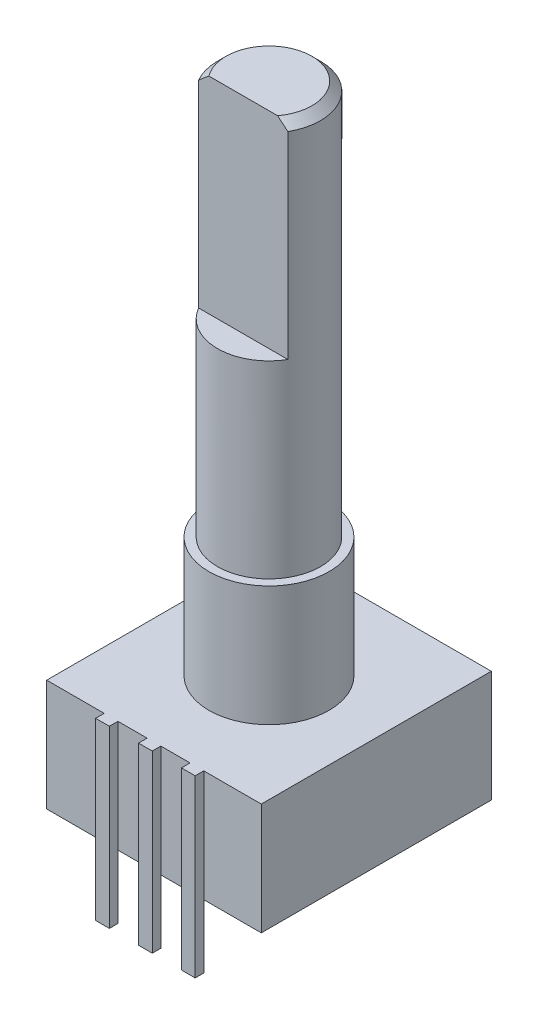
ISO-10303-21;
HEADER;
FILE_DESCRIPTION(('STEP AP214'),'2;1');
FILE_NAME('part.step','',(''),(''),'','','');
FILE_SCHEMA(('AUTOMOTIVE_DESIGN { 1 0 10303 214 1 1 1 1 }'));
ENDSEC;
DATA;
#1=APPLICATION_CONTEXT('core data for automotive mechanical design processes');
#2=APPLICATION_PROTOCOL_DEFINITION('international standard','automotive_design',2000,#1);
#3=PRODUCT_CONTEXT('',#1,'mechanical');
#4=PRODUCT('Part','Part','',(#3));
#5=PRODUCT_RELATED_PRODUCT_CATEGORY('part','',(#4));
#6=PRODUCT_DEFINITION_FORMATION('','',#4);
#7=PRODUCT_DEFINITION_CONTEXT('part definition',#1,'design');
#8=PRODUCT_DEFINITION('design','',#6,#7);
#9=PRODUCT_DEFINITION_SHAPE('','',#8);
#10=(LENGTH_UNIT() NAMED_UNIT(*) SI_UNIT(.MILLI.,.METRE.));
#11=(NAMED_UNIT(*) PLANE_ANGLE_UNIT() SI_UNIT($,.RADIAN.));
#12=(NAMED_UNIT(*) SI_UNIT($,.STERADIAN.) SOLID_ANGLE_UNIT());
#13=UNCERTAINTY_MEASURE_WITH_UNIT(LENGTH_MEASURE(1.E-05),#10,'distance_accuracy_value','');
#14=(GEOMETRIC_REPRESENTATION_CONTEXT(3) GLOBAL_UNCERTAINTY_ASSIGNED_CONTEXT((#13)) GLOBAL_UNIT_ASSIGNED_CONTEXT((#10,
#11,#12)) REPRESENTATION_CONTEXT('',''));
#15=CARTESIAN_POINT('',(0.,0.,0.));
#16=DIRECTION('',(0.,0.,1.));
#17=DIRECTION('',(1.,0.,0.));
#18=AXIS2_PLACEMENT_3D('',#15,#16,#17);
#19=CARTESIAN_POINT('',(6.25,-6.5,6.7));
#20=DIRECTION('',(0.,0.,1.));
#21=DIRECTION('',(1.,0.,0.));
#22=AXIS2_PLACEMENT_3D('',#19,#20,#21);
#23=PLANE('',#22);
#24=DIRECTION('',(1.,0.,0.));
#25=VECTOR('',#24,1.);
#26=CARTESIAN_POINT('',(6.25,-6.5,6.7));
#27=LINE('',#26,#25);
#28=CARTESIAN_POINT('',(0.400000000000001,-6.5,6.7));
#29=VERTEX_POINT('',#28);
#30=CARTESIAN_POINT('',(2.1,-6.5,6.7));
#31=VERTEX_POINT('',#30);
#32=EDGE_CURVE('E403',#29,#31,#27,.T.);
#33=ORIENTED_EDGE('',*,*,#32,.T.);
#34=DIRECTION('',(0.,-1.,0.));
#35=VECTOR('',#34,1.);
#36=CARTESIAN_POINT('',(2.1,0.,6.7));
#37=LINE('',#36,#35);
#38=CARTESIAN_POINT('',(2.1,0.,6.7));
#39=VERTEX_POINT('',#38);
#40=EDGE_CURVE('E404',#39,#31,#37,.T.);
#41=ORIENTED_EDGE('',*,*,#40,.F.);
#42=DIRECTION('',(1.,0.,0.));
#43=VECTOR('',#42,1.);
#44=CARTESIAN_POINT('',(6.25,0.,6.7));
#45=LINE('',#44,#43);
#46=CARTESIAN_POINT('',(0.400000000000001,0.,6.7));
#47=VERTEX_POINT('',#46);
#48=EDGE_CURVE('E220',#47,#39,#45,.T.);
#49=ORIENTED_EDGE('',*,*,#48,.F.);
#50=DIRECTION('',(0.,1.,0.));
#51=VECTOR('',#50,1.);
#52=CARTESIAN_POINT('',(0.4,0.,6.7));
#53=LINE('',#52,#51);
#54=EDGE_CURVE('E256',#29,#47,#53,.T.);
#55=ORIENTED_EDGE('',*,*,#54,.F.);
#56=EDGE_LOOP('',(#33,#41,#49,#55));
#57=FACE_BOUND('',#56,.T.);
#58=ADVANCED_FACE('F41',(#57),#23,.T.);
#59=CARTESIAN_POINT('',(2.9,0.,6.7));
#60=VERTEX_POINT('',#59);
#61=CARTESIAN_POINT('',(6.25,0.,6.7));
#62=VERTEX_POINT('',#61);
#63=EDGE_CURVE('E46',#60,#62,#45,.T.);
#64=ORIENTED_EDGE('',*,*,#63,.F.);
#65=DIRECTION('',(0.,1.,0.));
#66=VECTOR('',#65,1.);
#67=CARTESIAN_POINT('',(2.9,0.,6.7));
#68=LINE('',#67,#66);
#69=CARTESIAN_POINT('',(2.9,-6.5,6.7));
#70=VERTEX_POINT('',#69);
#71=EDGE_CURVE('E824',#70,#60,#68,.T.);
#72=ORIENTED_EDGE('',*,*,#71,.F.);
#73=CARTESIAN_POINT('',(6.25,-6.5,6.7));
#74=VERTEX_POINT('',#73);
#75=EDGE_CURVE('E407',#70,#74,#27,.T.);
#76=ORIENTED_EDGE('',*,*,#75,.T.);
#77=DIRECTION('',(0.,1.,0.));
#78=VECTOR('',#77,1.);
#79=CARTESIAN_POINT('',(6.25,-6.5,6.7));
#80=LINE('',#79,#78);
#81=EDGE_CURVE('E430',#74,#62,#80,.T.);
#82=ORIENTED_EDGE('',*,*,#81,.T.);
#83=EDGE_LOOP('',(#64,#72,#76,#82));
#84=FACE_BOUND('',#83,.T.);
#85=ADVANCED_FACE('F391',(#84),#23,.T.);
#86=CARTESIAN_POINT('',(-2.1,-6.5,6.7));
#87=VERTEX_POINT('',#86);
#88=CARTESIAN_POINT('',(-0.399999999999999,-6.5,6.7));
#89=VERTEX_POINT('',#88);
#90=EDGE_CURVE('E406',#87,#89,#27,.T.);
#91=ORIENTED_EDGE('',*,*,#90,.T.);
#92=DIRECTION('',(0.,-1.,0.));
#93=VECTOR('',#92,1.);
#94=CARTESIAN_POINT('',(-0.4,0.,6.7));
#95=LINE('',#94,#93);
#96=CARTESIAN_POINT('',(-0.4,0.,6.7));
#97=VERTEX_POINT('',#96);
#98=EDGE_CURVE('E249',#97,#89,#95,.T.);
#99=ORIENTED_EDGE('',*,*,#98,.F.);
#100=CARTESIAN_POINT('',(-2.1,0.,6.7));
#101=VERTEX_POINT('',#100);
#102=EDGE_CURVE('E316',#101,#97,#45,.T.);
#103=ORIENTED_EDGE('',*,*,#102,.F.);
#104=DIRECTION('',(0.,1.,0.));
#105=VECTOR('',#104,1.);
#106=CARTESIAN_POINT('',(-2.1,0.,6.7));
#107=LINE('',#106,#105);
#108=EDGE_CURVE('E12',#87,#101,#107,.T.);
#109=ORIENTED_EDGE('',*,*,#108,.F.);
#110=EDGE_LOOP('',(#91,#99,#103,#109));
#111=FACE_BOUND('',#110,.T.);
#112=ADVANCED_FACE('F385',(#111),#23,.T.);
#113=CARTESIAN_POINT('',(-6.25,-6.5,6.7));
#114=DIRECTION('',(-1.,0.,0.));
#115=DIRECTION('',(0.,0.,1.));
#116=AXIS2_PLACEMENT_3D('',#113,#114,#115);
#117=PLANE('',#116);
#118=DIRECTION('',(0.,0.,1.));
#119=VECTOR('',#118,1.);
#120=CARTESIAN_POINT('',(-6.25,0.,6.7));
#121=LINE('',#120,#119);
#122=CARTESIAN_POINT('',(-6.25,0.,-6.7));
#123=VERTEX_POINT('',#122);
#124=CARTESIAN_POINT('',(-6.25,0.,6.7));
#125=VERTEX_POINT('',#124);
#126=EDGE_CURVE('E320',#123,#125,#121,.T.);
#127=ORIENTED_EDGE('',*,*,#126,.F.);
#128=DIRECTION('',(0.,1.,0.));
#129=VECTOR('',#128,1.);
#130=CARTESIAN_POINT('',(-6.25,-6.5,-6.7));
#131=LINE('',#130,#129);
#132=CARTESIAN_POINT('',(-6.25,-6.5,-6.7));
#133=VERTEX_POINT('',#132);
#134=EDGE_CURVE('E442',#133,#123,#131,.T.);
#135=ORIENTED_EDGE('',*,*,#134,.F.);
#136=DIRECTION('',(0.,0.,1.));
#137=VECTOR('',#136,1.);
#138=CARTESIAN_POINT('',(-6.25,-6.5,6.7));
#139=LINE('',#138,#137);
#140=CARTESIAN_POINT('',(-6.25,-6.5,6.7));
#141=VERTEX_POINT('',#140);
#142=EDGE_CURVE('E415',#133,#141,#139,.T.);
#143=ORIENTED_EDGE('',*,*,#142,.T.);
#144=DIRECTION('',(0.,1.,0.));
#145=VECTOR('',#144,1.);
#146=CARTESIAN_POINT('',(-6.25,-6.5,6.7));
#147=LINE('',#146,#145);
#148=EDGE_CURVE('E427',#141,#125,#147,.T.);
#149=ORIENTED_EDGE('',*,*,#148,.T.);
#150=EDGE_LOOP('',(#127,#135,#143,#149));
#151=FACE_BOUND('',#150,.T.);
#152=ADVANCED_FACE('F378',(#151),#117,.T.);
#153=CARTESIAN_POINT('',(6.25,-6.5,-6.7));
#154=DIRECTION('',(0.,0.,-1.));
#155=DIRECTION('',(-1.,0.,0.));
#156=AXIS2_PLACEMENT_3D('',#153,#154,#155);
#157=PLANE('',#156);
#158=DIRECTION('',(-1.,0.,0.));
#159=VECTOR('',#158,1.);
#160=CARTESIAN_POINT('',(6.25,0.,-6.7));
#161=LINE('',#160,#159);
#162=CARTESIAN_POINT('',(6.25,0.,-6.7));
#163=VERTEX_POINT('',#162);
#164=EDGE_CURVE('E452',#163,#123,#161,.T.);
#165=ORIENTED_EDGE('',*,*,#164,.F.);
#166=DIRECTION('',(0.,1.,0.));
#167=VECTOR('',#166,1.);
#168=CARTESIAN_POINT('',(6.25,-6.5,-6.7));
#169=LINE('',#168,#167);
#170=CARTESIAN_POINT('',(6.25,-6.5,-6.7));
#171=VERTEX_POINT('',#170);
#172=EDGE_CURVE('E436',#171,#163,#169,.T.);
#173=ORIENTED_EDGE('',*,*,#172,.F.);
#174=DIRECTION('',(-1.,0.,0.));
#175=VECTOR('',#174,1.);
#176=CARTESIAN_POINT('',(6.25,-6.5,-6.7));
#177=LINE('',#176,#175);
#178=EDGE_CURVE('E424',#171,#133,#177,.T.);
#179=ORIENTED_EDGE('',*,*,#178,.T.);
#180=ORIENTED_EDGE('',*,*,#134,.T.);
#181=EDGE_LOOP('',(#165,#173,#179,#180));
#182=FACE_BOUND('',#181,.T.);
#183=ADVANCED_FACE('F374',(#182),#157,.T.);
#184=CARTESIAN_POINT('',(6.25,-6.5,6.7));
#185=DIRECTION('',(1.,0.,0.));
#186=DIRECTION('',(0.,0.,-1.));
#187=AXIS2_PLACEMENT_3D('',#184,#185,#186);
#188=PLANE('',#187);
#189=DIRECTION('',(0.,0.,-1.));
#190=VECTOR('',#189,1.);
#191=CARTESIAN_POINT('',(6.25,0.,6.7));
#192=LINE('',#191,#190);
#193=EDGE_CURVE('E322',#62,#163,#192,.T.);
#194=ORIENTED_EDGE('',*,*,#193,.F.);
#195=ORIENTED_EDGE('',*,*,#81,.F.);
#196=DIRECTION('',(0.,0.,-1.));
#197=VECTOR('',#196,1.);
#198=CARTESIAN_POINT('',(6.25,-6.5,6.7));
#199=LINE('',#198,#197);
#200=EDGE_CURVE('E420',#74,#171,#199,.T.);
#201=ORIENTED_EDGE('',*,*,#200,.T.);
#202=ORIENTED_EDGE('',*,*,#172,.T.);
#203=EDGE_LOOP('',(#194,#195,#201,#202));
#204=FACE_BOUND('',#203,.T.);
#205=ADVANCED_FACE('F377',(#204),#188,.T.);
#206=DIRECTION('',(0.,-1.,0.));
#207=VECTOR('',#206,1.);
#208=CARTESIAN_POINT('',(-2.9,0.,6.7));
#209=LINE('',#208,#207);
#210=CARTESIAN_POINT('',(-2.9,0.,6.7));
#211=VERTEX_POINT('',#210);
#212=CARTESIAN_POINT('',(-2.9,-6.5,6.7));
#213=VERTEX_POINT('',#212);
#214=EDGE_CURVE('E295',#211,#213,#209,.T.);
#215=ORIENTED_EDGE('',*,*,#214,.F.);
#216=EDGE_CURVE('E328',#125,#211,#45,.T.);
#217=ORIENTED_EDGE('',*,*,#216,.F.);
#218=ORIENTED_EDGE('',*,*,#148,.F.);
#219=EDGE_CURVE('E416',#141,#213,#27,.T.);
#220=ORIENTED_EDGE('',*,*,#219,.T.);
#221=EDGE_LOOP('',(#215,#217,#218,#220));
#222=FACE_BOUND('',#221,.T.);
#223=ADVANCED_FACE('F369',(#222),#23,.T.);
#224=CARTESIAN_POINT('',(0.,-6.5,0.));
#225=DIRECTION('',(0.,1.,0.));
#226=DIRECTION('',(0.,0.,1.));
#227=AXIS2_PLACEMENT_3D('',#224,#225,#226);
#228=PLANE('',#227);
#229=ORIENTED_EDGE('',*,*,#142,.F.);
#230=ORIENTED_EDGE('',*,*,#178,.F.);
#231=ORIENTED_EDGE('',*,*,#200,.F.);
#232=ORIENTED_EDGE('',*,*,#75,.F.);
#233=DIRECTION('',(-1.,0.,0.));
#234=VECTOR('',#233,1.);
#235=CARTESIAN_POINT('',(0.,-6.5,6.7));
#236=LINE('',#235,#234);
#237=EDGE_CURVE('E222',#70,#31,#236,.T.);
#238=ORIENTED_EDGE('',*,*,#237,.T.);
#239=ORIENTED_EDGE('',*,*,#32,.F.);
#240=DIRECTION('',(-1.,0.,0.));
#241=VECTOR('',#240,1.);
#242=CARTESIAN_POINT('',(0.,-6.5,6.7));
#243=LINE('',#242,#241);
#244=EDGE_CURVE('E273',#29,#89,#243,.T.);
#245=ORIENTED_EDGE('',*,*,#244,.T.);
#246=ORIENTED_EDGE('',*,*,#90,.F.);
#247=EDGE_CURVE('E413',#213,#87,#27,.T.);
#248=ORIENTED_EDGE('',*,*,#247,.F.);
#249=ORIENTED_EDGE('',*,*,#219,.F.);
#250=EDGE_LOOP('',(#229,#230,#231,#232,#238,#239,#245,#246,#248,#249));
#251=FACE_BOUND('',#250,.T.);
#252=ADVANCED_FACE('F366',(#251),#228,.F.);
#253=CARTESIAN_POINT('',(0.,0.,0.));
#254=DIRECTION('',(0.,1.,0.));
#255=DIRECTION('',(0.,0.,1.));
#256=AXIS2_PLACEMENT_3D('',#253,#254,#255);
#257=PLANE('',#256);
#258=CARTESIAN_POINT('',(0.,0.,0.));
#259=DIRECTION('',(0.,1.,0.));
#260=DIRECTION('',(0.,0.,1.));
#261=AXIS2_PLACEMENT_3D('',#258,#259,#260);
#262=CIRCLE('',#261,3.5);
#263=CARTESIAN_POINT('',(0.,0.,3.5));
#264=VERTEX_POINT('',#263);
#265=EDGE_CURVE('E470',#264,#264,#262,.T.);
#266=ORIENTED_EDGE('',*,*,#265,.F.);
#267=EDGE_LOOP('',(#266));
#268=FACE_BOUND('',#267,.T.);
#269=ORIENTED_EDGE('',*,*,#126,.T.);
#270=ORIENTED_EDGE('',*,*,#216,.T.);
#271=DIRECTION('',(0.,0.,-1.));
#272=VECTOR('',#271,1.);
#273=CARTESIAN_POINT('',(-2.9,0.,7.2));
#274=LINE('',#273,#272);
#275=CARTESIAN_POINT('',(-2.9,0.,7.2));
#276=VERTEX_POINT('',#275);
#277=EDGE_CURVE('E303',#276,#211,#274,.T.);
#278=ORIENTED_EDGE('',*,*,#277,.F.);
#279=DIRECTION('',(-1.,0.,0.));
#280=VECTOR('',#279,1.);
#281=CARTESIAN_POINT('',(-2.9,0.,7.2));
#282=LINE('',#281,#280);
#283=CARTESIAN_POINT('',(-2.1,0.,7.2));
#284=VERTEX_POINT('',#283);
#285=EDGE_CURVE('E278',#284,#276,#282,.T.);
#286=ORIENTED_EDGE('',*,*,#285,.F.);
#287=DIRECTION('',(0.,0.,-1.));
#288=VECTOR('',#287,1.);
#289=CARTESIAN_POINT('',(-2.1,0.,7.2));
#290=LINE('',#289,#288);
#291=EDGE_CURVE('E291',#284,#101,#290,.T.);
#292=ORIENTED_EDGE('',*,*,#291,.T.);
#293=ORIENTED_EDGE('',*,*,#102,.T.);
#294=DIRECTION('',(0.,0.,-1.));
#295=VECTOR('',#294,1.);
#296=CARTESIAN_POINT('',(-0.4,0.,7.2));
#297=LINE('',#296,#295);
#298=CARTESIAN_POINT('',(-0.4,0.,7.2));
#299=VERTEX_POINT('',#298);
#300=EDGE_CURVE('E270',#299,#97,#297,.T.);
#301=ORIENTED_EDGE('',*,*,#300,.F.);
#302=DIRECTION('',(-1.,0.,0.));
#303=VECTOR('',#302,1.);
#304=CARTESIAN_POINT('',(-0.4,0.,7.2));
#305=LINE('',#304,#303);
#306=CARTESIAN_POINT('',(0.4,0.,7.2));
#307=VERTEX_POINT('',#306);
#308=EDGE_CURVE('E235',#307,#299,#305,.T.);
#309=ORIENTED_EDGE('',*,*,#308,.F.);
#310=DIRECTION('',(0.,0.,-1.));
#311=VECTOR('',#310,1.);
#312=CARTESIAN_POINT('',(0.4,0.,7.2));
#313=LINE('',#312,#311);
#314=EDGE_CURVE('E68',#307,#47,#313,.T.);
#315=ORIENTED_EDGE('',*,*,#314,.T.);
#316=ORIENTED_EDGE('',*,*,#48,.T.);
#317=DIRECTION('',(0.,0.,-1.));
#318=VECTOR('',#317,1.);
#319=CARTESIAN_POINT('',(2.1,0.,7.2));
#320=LINE('',#319,#318);
#321=CARTESIAN_POINT('',(2.1,0.,7.2));
#322=VERTEX_POINT('',#321);
#323=EDGE_CURVE('E201',#322,#39,#320,.T.);
#324=ORIENTED_EDGE('',*,*,#323,.F.);
#325=DIRECTION('',(-1.,0.,0.));
#326=VECTOR('',#325,1.);
#327=CARTESIAN_POINT('',(2.1,0.,7.2));
#328=LINE('',#327,#326);
#329=CARTESIAN_POINT('',(2.9,0.,7.2));
#330=VERTEX_POINT('',#329);
#331=EDGE_CURVE('E209',#330,#322,#328,.T.);
#332=ORIENTED_EDGE('',*,*,#331,.F.);
#333=DIRECTION('',(0.,0.,-1.));
#334=VECTOR('',#333,1.);
#335=CARTESIAN_POINT('',(2.9,0.,7.2));
#336=LINE('',#335,#334);
#337=EDGE_CURVE('E61',#330,#60,#336,.T.);
#338=ORIENTED_EDGE('',*,*,#337,.T.);
#339=ORIENTED_EDGE('',*,*,#63,.T.);
#340=ORIENTED_EDGE('',*,*,#193,.T.);
#341=ORIENTED_EDGE('',*,*,#164,.T.);
#342=EDGE_LOOP('',(#269,#270,#278,#286,#292,#293,#301,#309,#315,#316,#324,#332,#338,#339,#340,#341));
#343=FACE_BOUND('',#342,.T.);
#344=ADVANCED_FACE('F218',(#268,#343),#257,.T.);
#345=CARTESIAN_POINT('',(0.,7.,0.));
#346=DIRECTION('',(0.,-1.,0.));
#347=DIRECTION('',(0.,0.,-1.));
#348=AXIS2_PLACEMENT_3D('',#345,#346,#347);
#349=CYLINDRICAL_SURFACE('',#348,3.5);
#350=CARTESIAN_POINT('',(0.,7.,0.));
#351=DIRECTION('',(0.,1.,0.));
#352=DIRECTION('',(0.,0.,1.));
#353=AXIS2_PLACEMENT_3D('',#350,#351,#352);
#354=CIRCLE('',#353,3.5);
#355=CARTESIAN_POINT('',(0.,7.,3.5));
#356=VERTEX_POINT('',#355);
#357=EDGE_CURVE('E467',#356,#356,#354,.T.);
#358=ORIENTED_EDGE('',*,*,#357,.F.);
#359=EDGE_LOOP('',(#358));
#360=FACE_BOUND('',#359,.T.);
#361=ORIENTED_EDGE('',*,*,#265,.T.);
#362=EDGE_LOOP('',(#361));
#363=FACE_BOUND('',#362,.T.);
#364=ADVANCED_FACE('F361',(#360,#363),#349,.T.);
#365=CARTESIAN_POINT('',(0.,7.,0.));
#366=DIRECTION('',(0.,1.,0.));
#367=DIRECTION('',(0.,0.,1.));
#368=AXIS2_PLACEMENT_3D('',#365,#366,#367);
#369=PLANE('',#368);
#370=CARTESIAN_POINT('',(0.,7.,0.));
#371=DIRECTION('',(0.,1.,0.));
#372=DIRECTION('',(0.,0.,1.));
#373=AXIS2_PLACEMENT_3D('',#370,#371,#372);
#374=CIRCLE('',#373,3.);
#375=CARTESIAN_POINT('',(0.,7.,3.));
#376=VERTEX_POINT('',#375);
#377=EDGE_CURVE('E476',#376,#376,#374,.T.);
#378=ORIENTED_EDGE('',*,*,#377,.F.);
#379=EDGE_LOOP('',(#378));
#380=FACE_BOUND('',#379,.T.);
#381=ORIENTED_EDGE('',*,*,#357,.T.);
#382=EDGE_LOOP('',(#381));
#383=FACE_BOUND('',#382,.T.);
#384=ADVANCED_FACE('F357',(#380,#383),#369,.T.);
#385=CARTESIAN_POINT('',(0.,30.,0.));
#386=DIRECTION('',(0.,-1.,0.));
#387=DIRECTION('',(0.,0.,-1.));
#388=AXIS2_PLACEMENT_3D('',#385,#386,#387);
#389=CYLINDRICAL_SURFACE('',#388,3.);
#390=CARTESIAN_POINT('',(0.,29.5,0.));
#391=DIRECTION('',(0.,1.,0.));
#392=DIRECTION('',(0.,0.,1.));
#393=AXIS2_PLACEMENT_3D('',#390,#391,#392);
#394=CIRCLE('',#393,3.);
#395=CARTESIAN_POINT('',(-2.59807621135332,29.5,1.5));
#396=VERTEX_POINT('',#395);
#397=CARTESIAN_POINT('',(2.59807621135332,29.5,1.5));
#398=VERTEX_POINT('',#397);
#399=EDGE_CURVE('E340',#396,#398,#394,.F.);
#400=ORIENTED_EDGE('',*,*,#399,.T.);
#401=DIRECTION('',(0.,1.,0.));
#402=VECTOR('',#401,1.);
#403=CARTESIAN_POINT('',(2.59807621135332,18.,1.5));
#404=LINE('',#403,#402);
#405=CARTESIAN_POINT('',(2.59807621135332,18.,1.5));
#406=VERTEX_POINT('',#405);
#407=EDGE_CURVE('E482',#406,#398,#404,.T.);
#408=ORIENTED_EDGE('',*,*,#407,.F.);
#409=CARTESIAN_POINT('',(0.,18.,0.));
#410=DIRECTION('',(0.,1.,0.));
#411=DIRECTION('',(0.,0.,1.));
#412=AXIS2_PLACEMENT_3D('',#409,#410,#411);
#413=CIRCLE('',#412,3.);
#414=CARTESIAN_POINT('',(-2.59807621135332,18.,1.5));
#415=VERTEX_POINT('',#414);
#416=EDGE_CURVE('E491',#415,#406,#413,.T.);
#417=ORIENTED_EDGE('',*,*,#416,.F.);
#418=DIRECTION('',(0.,1.,0.));
#419=VECTOR('',#418,1.);
#420=CARTESIAN_POINT('',(-2.59807621135332,18.,1.5));
#421=LINE('',#420,#419);
#422=EDGE_CURVE('E481',#415,#396,#421,.T.);
#423=ORIENTED_EDGE('',*,*,#422,.T.);
#424=EDGE_LOOP('',(#400,#408,#417,#423));
#425=FACE_BOUND('',#424,.T.);
#426=ORIENTED_EDGE('',*,*,#377,.T.);
#427=EDGE_LOOP('',(#426));
#428=FACE_BOUND('',#427,.T.);
#429=ADVANCED_FACE('F353',(#425,#428),#389,.T.);
#430=CARTESIAN_POINT('',(0.,30.,0.));
#431=DIRECTION('',(0.,1.,0.));
#432=DIRECTION('',(0.,0.,1.));
#433=AXIS2_PLACEMENT_3D('',#430,#431,#432);
#434=PLANE('',#433);
#435=DIRECTION('',(-1.,0.,0.));
#436=VECTOR('',#435,1.);
#437=CARTESIAN_POINT('',(-2.59807621135332,30.,1.5));
#438=LINE('',#437,#436);
#439=CARTESIAN_POINT('',(2.00000000000001,30.,1.5));
#440=VERTEX_POINT('',#439);
#441=CARTESIAN_POINT('',(-2.00000000000001,30.,1.5));
#442=VERTEX_POINT('',#441);
#443=EDGE_CURVE('E306',#440,#442,#438,.T.);
#444=ORIENTED_EDGE('',*,*,#443,.F.);
#445=CARTESIAN_POINT('',(0.,30.,0.));
#446=DIRECTION('',(0.,1.,0.));
#447=DIRECTION('',(0.,0.,1.));
#448=AXIS2_PLACEMENT_3D('',#445,#446,#447);
#449=CIRCLE('',#448,2.50000000000001);
#450=EDGE_CURVE('E439',#440,#442,#449,.T.);
#451=ORIENTED_EDGE('',*,*,#450,.T.);
#452=EDGE_LOOP('',(#444,#451));
#453=FACE_BOUND('',#452,.T.);
#454=ADVANCED_FACE('F350',(#453),#434,.T.);
#455=CARTESIAN_POINT('',(0.,30.,0.));
#456=DIRECTION('',(0.,-1.,0.));
#457=DIRECTION('',(0.,0.,-1.));
#458=AXIS2_PLACEMENT_3D('',#455,#456,#457);
#459=CONICAL_SURFACE('',#458,2.50000000000001,0.785398163397446);
#460=CARTESIAN_POINT('',(5.73036816402648,26.5765618687043,1.5));
#461=CARTESIAN_POINT('',(5.6000787171588,26.7025974167125,1.5));
#462=CARTESIAN_POINT('',(5.46965818617232,26.8284979068373,1.5));
#463=CARTESIAN_POINT('',(5.20847655807187,27.0799484772278,1.5));
#464=CARTESIAN_POINT('',(5.07771545653842,27.2054985529021,1.5));
#465=CARTESIAN_POINT('',(4.81570961377251,27.4562298494928,1.5));
#466=CARTESIAN_POINT('',(4.6844646564946,27.5814108447844,1.5));
#467=CARTESIAN_POINT('',(4.42144960024607,27.8312185849797,1.5));
#468=CARTESIAN_POINT('',(4.28967950474543,27.9558453335343,1.5));
#469=CARTESIAN_POINT('',(4.02810275176369,28.2018981149924,1.5));
#470=CARTESIAN_POINT('',(3.89830946382121,28.3233383491107,1.5));
#471=CARTESIAN_POINT('',(3.63787548488999,28.565306426204,1.5));
#472=CARTESIAN_POINT('',(3.50723479953073,28.6858342752287,1.5));
#473=CARTESIAN_POINT('',(3.24484528184075,28.9256215226849,1.5));
#474=CARTESIAN_POINT('',(3.11309669786177,29.0448811925023,1.5));
#475=CARTESIAN_POINT('',(2.84804042665363,29.2816522557944,1.5));
#476=CARTESIAN_POINT('',(2.71473280382571,29.3991637210321,1.5));
#477=CARTESIAN_POINT('',(2.4983342374001,29.5862411449998,1.5));
#478=CARTESIAN_POINT('',(2.41594822823631,29.6566215024049,1.5));
#479=CARTESIAN_POINT('',(2.25010172005608,29.7961249323765,1.5));
#480=CARTESIAN_POINT('',(2.16664111651114,29.8652478810296,1.5));
#481=CARTESIAN_POINT('',(1.99745353333167,30.0025319464356,1.5));
#482=CARTESIAN_POINT('',(1.9117119030147,30.0706750779762,1.5));
#483=CARTESIAN_POINT('',(1.73840152432047,30.2045679934366,1.5));
#484=CARTESIAN_POINT('',(1.650833219107,30.2703183474768,1.5));
#485=CARTESIAN_POINT('',(1.47187367126119,30.3994048655951,1.5));
#486=CARTESIAN_POINT('',(1.38044448151396,30.4626888745061,1.5));
#487=CARTESIAN_POINT('',(1.19399685569392,30.5841164465603,1.5));
#488=CARTESIAN_POINT('',(1.09897373432294,30.6422529445236,1.5));
#489=CARTESIAN_POINT('',(0.90552029107012,30.7497010361629,1.5));
#490=CARTESIAN_POINT('',(0.807147083614985,30.7991134450896,1.5));
#491=CARTESIAN_POINT('',(0.604998967756408,30.8851429229097,1.5));
#492=CARTESIAN_POINT('',(0.501243586610067,30.9218029745791,1.5));
#493=CARTESIAN_POINT('',(0.345633723630404,30.9614369611693,1.5));
#494=CARTESIAN_POINT('',(0.29569507997391,30.9719413085412,1.5));
#495=CARTESIAN_POINT('',(0.195034109633765,30.9881877836228,1.5));
#496=CARTESIAN_POINT('',(0.14431185179769,30.9939303273033,1.5));
#497=CARTESIAN_POINT('',(0.042696548439802,31.0002466384502,1.5));
#498=CARTESIAN_POINT('',(-0.00819550403491198,31.0008361204801,1.5));
#499=CARTESIAN_POINT('',(-0.10977690414251,30.9968451940819,1.5));
#500=CARTESIAN_POINT('',(-0.160466234398105,30.9922643515993,1.5));
#501=CARTESIAN_POINT('',(-0.260716679584098,30.9783141015677,1.5));
#502=CARTESIAN_POINT('',(-0.310283780930353,30.9689868528564,1.5));
#503=CARTESIAN_POINT('',(-0.408440627273626,30.9461201550716,1.5));
#504=CARTESIAN_POINT('',(-0.457029981472907,30.9325790560114,1.5));
#505=CARTESIAN_POINT('',(-0.553326011397891,30.9018532005524,1.5));
#506=CARTESIAN_POINT('',(-0.601026258357522,30.8846485574018,1.5));
#507=CARTESIAN_POINT('',(-0.695227937486876,30.8472824513675,1.5));
#508=CARTESIAN_POINT('',(-0.74172961325136,30.8271215949586,1.5));
#509=CARTESIAN_POINT('',(-0.880295441643013,30.7627129352029,1.5));
#510=CARTESIAN_POINT('',(-0.970652404721794,30.7148029349267,1.5));
#511=CARTESIAN_POINT('',(-1.14774398825843,30.6126498154618,1.5));
#512=CARTESIAN_POINT('',(-1.23447398589624,30.5583989295031,1.5));
#513=CARTESIAN_POINT('',(-1.40545729190777,30.4454482765884,1.5));
#514=CARTESIAN_POINT('',(-1.48969942041261,30.3867317274162,1.5));
#515=CARTESIAN_POINT('',(-1.65599320744187,30.2663863901267,1.5));
#516=CARTESIAN_POINT('',(-1.73804592559998,30.2047590523059,1.5));
#517=CARTESIAN_POINT('',(-1.90159045519275,30.0785734195475,1.5));
#518=CARTESIAN_POINT('',(-1.98306062185793,30.0139872007741,1.5));
#519=CARTESIAN_POINT('',(-2.14471599676088,29.8832155452279,1.5));
#520=CARTESIAN_POINT('',(-2.22490106806423,29.8170299398909,1.5));
#521=CARTESIAN_POINT('',(-2.4635719449822,29.6170164548306,1.5));
#522=CARTESIAN_POINT('',(-2.62057152409112,29.4814179823797,1.5));
#523=CARTESIAN_POINT('',(-2.90554911792732,29.2306711349932,1.5));
#524=CARTESIAN_POINT('',(-3.03392172382318,29.1159669211225,1.5));
#525=CARTESIAN_POINT('',(-3.28939915984928,28.8851483822198,1.5));
#526=CARTESIAN_POINT('',(-3.41650395458176,28.7690340180154,1.5));
#527=CARTESIAN_POINT('',(-3.79666887135183,28.418967518695,1.5));
#528=CARTESIAN_POINT('',(-4.04833785030263,28.1835075389644,1.5));
#529=CARTESIAN_POINT('',(-4.53919453299732,27.7200266226884,1.5));
#530=CARTESIAN_POINT('',(-4.77846985479958,27.4920980320781,1.5));
#531=CARTESIAN_POINT('',(-5.13625909846269,27.1492988392595,1.5));
#532=CARTESIAN_POINT('',(-5.25526890602998,27.0349453446273,1.5));
#533=CARTESIAN_POINT('',(-5.49301208265659,26.8059532483843,1.5));
#534=CARTESIAN_POINT('',(-5.61174545396393,26.6913146491076,1.5));
#535=CARTESIAN_POINT('',(-5.73036816402648,26.5765618687043,1.5));
#536=B_SPLINE_CURVE_WITH_KNOTS('',3,(#460,#461,#462,#463,#464,#465,#466,#467,#468,#469,#470,
#471,#472,#473,#474,#475,#476,#477,#478,#479,#480,#481,#482,#483,#484,#485,#486,#487,#488,#489,
#490,#491,#492,#493,#494,#495,#496,#497,#498,#499,#500,#501,#502,#503,#504,#505,#506,#507,#508,
#509,#510,#511,#512,#513,#514,#515,#516,#517,#518,#519,#520,#521,#522,#523,#524,#525,#526,#527,
#528,#529,#530,#531,#532,#533,#534,#535),.UNSPECIFIED.,.F.,.F.,(4,2,2,2,2,2,2,2,2,2,2,2,2,2,2,2,
2,2,2,2,2,2,2,2,2,2,2,2,2,2,2,2,2,2,2,2,2,4),(0.,0.543822672560257,1.08765243764232,
1.6317648543638,2.17587368167169,2.70911181517816,3.24234640986466,3.77546449986789,
4.30856064491679,4.63361700224004,4.95870522114833,5.2872424735058,5.61570092673361,
5.94917191607113,6.28309373433041,6.61286019505047,6.94150413098423,7.09440456377158,
7.24729163842372,7.39971231171669,7.55214578184434,7.7032483341502,7.85441012718687,
8.00641439740955,8.15838752707991,8.46475613805573,8.77150402340092,9.07946780487115,
9.38727972995408,9.69914844039609,10.0110501642367,10.6333333681641,11.149782797892,
11.6662466069453,12.7001456119347,13.691521081202,14.1866574766612,14.6817898314501),.UNSPECIFIED.);
#537=EDGE_CURVE('E53',#398,#440,#536,.T.);
#538=ORIENTED_EDGE('',*,*,#537,.F.);
#539=ORIENTED_EDGE('',*,*,#399,.F.);
#540=EDGE_CURVE('E332',#442,#396,#536,.T.);
#541=ORIENTED_EDGE('',*,*,#540,.F.);
#542=ORIENTED_EDGE('',*,*,#450,.F.);
#543=EDGE_LOOP('',(#538,#539,#541,#542));
#544=FACE_BOUND('',#543,.T.);
#545=ADVANCED_FACE('F43',(#544),#459,.T.);
#546=CARTESIAN_POINT('',(-2.59807621135332,18.,1.5));
#547=DIRECTION('',(0.,0.,-1.));
#548=DIRECTION('',(-1.,0.,0.));
#549=AXIS2_PLACEMENT_3D('',#546,#547,#548);
#550=PLANE('',#549);
#551=ORIENTED_EDGE('',*,*,#537,.T.);
#552=ORIENTED_EDGE('',*,*,#443,.T.);
#553=ORIENTED_EDGE('',*,*,#540,.T.);
#554=ORIENTED_EDGE('',*,*,#422,.F.);
#555=DIRECTION('',(-1.,0.,0.));
#556=VECTOR('',#555,1.);
#557=CARTESIAN_POINT('',(-2.59807621135332,18.,1.5));
#558=LINE('',#557,#556);
#559=EDGE_CURVE('E485',#406,#415,#558,.T.);
#560=ORIENTED_EDGE('',*,*,#559,.F.);
#561=ORIENTED_EDGE('',*,*,#407,.T.);
#562=EDGE_LOOP('',(#551,#552,#553,#554,#560,#561));
#563=FACE_BOUND('',#562,.T.);
#564=ADVANCED_FACE('F342',(#563),#550,.F.);
#565=CARTESIAN_POINT('',(0.,18.,0.));
#566=DIRECTION('',(0.,1.,0.));
#567=DIRECTION('',(0.,0.,1.));
#568=AXIS2_PLACEMENT_3D('',#565,#566,#567);
#569=PLANE('',#568);
#570=ORIENTED_EDGE('',*,*,#416,.T.);
#571=ORIENTED_EDGE('',*,*,#559,.T.);
#572=EDGE_LOOP('',(#570,#571));
#573=FACE_BOUND('',#572,.T.);
#574=ADVANCED_FACE('F347',(#573),#569,.T.);
#575=CARTESIAN_POINT('',(-2.9,0.,7.2));
#576=DIRECTION('',(1.,0.,0.));
#577=DIRECTION('',(0.,1.,0.));
#578=AXIS2_PLACEMENT_3D('',#575,#576,#577);
#579=PLANE('',#578);
#580=ORIENTED_EDGE('',*,*,#214,.T.);
#581=CARTESIAN_POINT('',(-2.9,-10.2,6.7));
#582=VERTEX_POINT('',#581);
#583=EDGE_CURVE('E277',#213,#582,#209,.T.);
#584=ORIENTED_EDGE('',*,*,#583,.T.);
#585=DIRECTION('',(0.,0.,-1.));
#586=VECTOR('',#585,1.);
#587=CARTESIAN_POINT('',(-2.9,-10.2,7.2));
#588=LINE('',#587,#586);
#589=CARTESIAN_POINT('',(-2.9,-10.2,7.2));
#590=VERTEX_POINT('',#589);
#591=EDGE_CURVE('E307',#590,#582,#588,.T.);
#592=ORIENTED_EDGE('',*,*,#591,.F.);
#593=DIRECTION('',(0.,-1.,0.));
#594=VECTOR('',#593,1.);
#595=CARTESIAN_POINT('',(-2.9,0.,7.2));
#596=LINE('',#595,#594);
#597=EDGE_CURVE('E282',#276,#590,#596,.T.);
#598=ORIENTED_EDGE('',*,*,#597,.F.);
#599=ORIENTED_EDGE('',*,*,#277,.T.);
#600=EDGE_LOOP('',(#580,#584,#592,#598,#599));
#601=FACE_BOUND('',#600,.T.);
#602=ADVANCED_FACE('F533',(#601),#579,.F.);
#603=CARTESIAN_POINT('',(-2.9,-10.2,7.2));
#604=DIRECTION('',(0.,1.,0.));
#605=DIRECTION('',(0.,0.,1.));
#606=AXIS2_PLACEMENT_3D('',#603,#604,#605);
#607=PLANE('',#606);
#608=DIRECTION('',(1.,0.,0.));
#609=VECTOR('',#608,1.);
#610=CARTESIAN_POINT('',(-2.9,-10.2,6.7));
#611=LINE('',#610,#609);
#612=CARTESIAN_POINT('',(-2.1,-10.2,6.7));
#613=VERTEX_POINT('',#612);
#614=EDGE_CURVE('E296',#582,#613,#611,.T.);
#615=ORIENTED_EDGE('',*,*,#614,.T.);
#616=DIRECTION('',(0.,0.,-1.));
#617=VECTOR('',#616,1.);
#618=CARTESIAN_POINT('',(-2.1,-10.2,7.2));
#619=LINE('',#618,#617);
#620=CARTESIAN_POINT('',(-2.1,-10.2,7.2));
#621=VERTEX_POINT('',#620);
#622=EDGE_CURVE('E313',#621,#613,#619,.T.);
#623=ORIENTED_EDGE('',*,*,#622,.F.);
#624=DIRECTION('',(1.,0.,0.));
#625=VECTOR('',#624,1.);
#626=CARTESIAN_POINT('',(-2.9,-10.2,7.2));
#627=LINE('',#626,#625);
#628=EDGE_CURVE('E286',#590,#621,#627,.T.);
#629=ORIENTED_EDGE('',*,*,#628,.F.);
#630=ORIENTED_EDGE('',*,*,#591,.T.);
#631=EDGE_LOOP('',(#615,#623,#629,#630));
#632=FACE_BOUND('',#631,.T.);
#633=ADVANCED_FACE('F513',(#632),#607,.F.);
#634=CARTESIAN_POINT('',(-2.1,0.,7.2));
#635=DIRECTION('',(-1.,0.,0.));
#636=DIRECTION('',(0.,-1.,0.));
#637=AXIS2_PLACEMENT_3D('',#634,#635,#636);
#638=PLANE('',#637);
#639=EDGE_CURVE('E283',#613,#87,#107,.T.);
#640=ORIENTED_EDGE('',*,*,#639,.T.);
#641=ORIENTED_EDGE('',*,*,#108,.T.);
#642=ORIENTED_EDGE('',*,*,#291,.F.);
#643=DIRECTION('',(0.,1.,0.));
#644=VECTOR('',#643,1.);
#645=CARTESIAN_POINT('',(-2.1,0.,7.2));
#646=LINE('',#645,#644);
#647=EDGE_CURVE('E288',#621,#284,#646,.T.);
#648=ORIENTED_EDGE('',*,*,#647,.F.);
#649=ORIENTED_EDGE('',*,*,#622,.T.);
#650=EDGE_LOOP('',(#640,#641,#642,#648,#649));
#651=FACE_BOUND('',#650,.T.);
#652=ADVANCED_FACE('F519',(#651),#638,.F.);
#653=CARTESIAN_POINT('',(0.,0.,7.2));
#654=DIRECTION('',(0.,0.,-1.));
#655=DIRECTION('',(-1.,0.,0.));
#656=AXIS2_PLACEMENT_3D('',#653,#654,#655);
#657=PLANE('',#656);
#658=ORIENTED_EDGE('',*,*,#285,.T.);
#659=ORIENTED_EDGE('',*,*,#597,.T.);
#660=ORIENTED_EDGE('',*,*,#628,.T.);
#661=ORIENTED_EDGE('',*,*,#647,.T.);
#662=EDGE_LOOP('',(#658,#659,#660,#661));
#663=FACE_BOUND('',#662,.T.);
#664=ADVANCED_FACE('F531',(#663),#657,.F.);
#665=CARTESIAN_POINT('',(0.,0.,6.7));
#666=DIRECTION('',(0.,0.,-1.));
#667=DIRECTION('',(-1.,0.,0.));
#668=AXIS2_PLACEMENT_3D('',#665,#666,#667);
#669=PLANE('',#668);
#670=ORIENTED_EDGE('',*,*,#583,.F.);
#671=ORIENTED_EDGE('',*,*,#247,.T.);
#672=ORIENTED_EDGE('',*,*,#639,.F.);
#673=ORIENTED_EDGE('',*,*,#614,.F.);
#674=EDGE_LOOP('',(#670,#671,#672,#673));
#675=FACE_BOUND('',#674,.T.);
#676=ADVANCED_FACE('F522',(#675),#669,.T.);
#677=CARTESIAN_POINT('',(0.,0.,6.7));
#678=DIRECTION('',(0.,0.,-1.));
#679=DIRECTION('',(-1.,0.,0.));
#680=AXIS2_PLACEMENT_3D('',#677,#678,#679);
#681=PLANE('',#680);
#682=ORIENTED_EDGE('',*,*,#244,.F.);
#683=CARTESIAN_POINT('',(0.400000000000001,-10.2,6.7));
#684=VERTEX_POINT('',#683);
#685=EDGE_CURVE('E240',#684,#29,#53,.T.);
#686=ORIENTED_EDGE('',*,*,#685,.F.);
#687=DIRECTION('',(1.,0.,0.));
#688=VECTOR('',#687,1.);
#689=CARTESIAN_POINT('',(-0.399999999999999,-10.2,6.7));
#690=LINE('',#689,#688);
#691=CARTESIAN_POINT('',(-0.399999999999999,-10.2,6.7));
#692=VERTEX_POINT('',#691);
#693=EDGE_CURVE('E253',#692,#684,#690,.T.);
#694=ORIENTED_EDGE('',*,*,#693,.F.);
#695=EDGE_CURVE('E228',#89,#692,#95,.T.);
#696=ORIENTED_EDGE('',*,*,#695,.F.);
#697=EDGE_LOOP('',(#682,#686,#694,#696));
#698=FACE_BOUND('',#697,.T.);
#699=ADVANCED_FACE('F546',(#698),#681,.T.);
#700=CARTESIAN_POINT('',(-0.4,0.,7.2));
#701=DIRECTION('',(1.,0.,0.));
#702=DIRECTION('',(0.,1.,0.));
#703=AXIS2_PLACEMENT_3D('',#700,#701,#702);
#704=PLANE('',#703);
#705=ORIENTED_EDGE('',*,*,#98,.T.);
#706=ORIENTED_EDGE('',*,*,#695,.T.);
#707=DIRECTION('',(0.,0.,-1.));
#708=VECTOR('',#707,1.);
#709=CARTESIAN_POINT('',(-0.399999999999999,-10.2,7.2));
#710=LINE('',#709,#708);
#711=CARTESIAN_POINT('',(-0.399999999999999,-10.2,7.2));
#712=VERTEX_POINT('',#711);
#713=EDGE_CURVE('E266',#712,#692,#710,.T.);
#714=ORIENTED_EDGE('',*,*,#713,.F.);
#715=DIRECTION('',(0.,-1.,0.));
#716=VECTOR('',#715,1.);
#717=CARTESIAN_POINT('',(-0.4,0.,7.2));
#718=LINE('',#717,#716);
#719=EDGE_CURVE('E239',#299,#712,#718,.T.);
#720=ORIENTED_EDGE('',*,*,#719,.F.);
#721=ORIENTED_EDGE('',*,*,#300,.T.);
#722=EDGE_LOOP('',(#705,#706,#714,#720,#721));
#723=FACE_BOUND('',#722,.T.);
#724=ADVANCED_FACE('F549',(#723),#704,.F.);
#725=CARTESIAN_POINT('',(-0.399999999999999,-10.2,7.2));
#726=DIRECTION('',(0.,1.,0.));
#727=DIRECTION('',(0.,0.,1.));
#728=AXIS2_PLACEMENT_3D('',#725,#726,#727);
#729=PLANE('',#728);
#730=ORIENTED_EDGE('',*,*,#693,.T.);
#731=DIRECTION('',(0.,0.,-1.));
#732=VECTOR('',#731,1.);
#733=CARTESIAN_POINT('',(0.400000000000001,-10.2,7.2));
#734=LINE('',#733,#732);
#735=CARTESIAN_POINT('',(0.400000000000001,-10.2,7.2));
#736=VERTEX_POINT('',#735);
#737=EDGE_CURVE('E262',#736,#684,#734,.T.);
#738=ORIENTED_EDGE('',*,*,#737,.F.);
#739=DIRECTION('',(1.,0.,0.));
#740=VECTOR('',#739,1.);
#741=CARTESIAN_POINT('',(-0.399999999999999,-10.2,7.2));
#742=LINE('',#741,#740);
#743=EDGE_CURVE('E243',#712,#736,#742,.T.);
#744=ORIENTED_EDGE('',*,*,#743,.F.);
#745=ORIENTED_EDGE('',*,*,#713,.T.);
#746=EDGE_LOOP('',(#730,#738,#744,#745));
#747=FACE_BOUND('',#746,.T.);
#748=ADVANCED_FACE('F552',(#747),#729,.F.);
#749=CARTESIAN_POINT('',(0.4,0.,7.2));
#750=DIRECTION('',(-1.,0.,0.));
#751=DIRECTION('',(0.,-1.,0.));
#752=AXIS2_PLACEMENT_3D('',#749,#750,#751);
#753=PLANE('',#752);
#754=ORIENTED_EDGE('',*,*,#685,.T.);
#755=ORIENTED_EDGE('',*,*,#54,.T.);
#756=ORIENTED_EDGE('',*,*,#314,.F.);
#757=DIRECTION('',(0.,1.,0.));
#758=VECTOR('',#757,1.);
#759=CARTESIAN_POINT('',(0.4,0.,7.2));
#760=LINE('',#759,#758);
#761=EDGE_CURVE('E246',#736,#307,#760,.T.);
#762=ORIENTED_EDGE('',*,*,#761,.F.);
#763=ORIENTED_EDGE('',*,*,#737,.T.);
#764=EDGE_LOOP('',(#754,#755,#756,#762,#763));
#765=FACE_BOUND('',#764,.T.);
#766=ADVANCED_FACE('F556',(#765),#753,.F.);
#767=CARTESIAN_POINT('',(0.,0.,7.2));
#768=DIRECTION('',(0.,0.,-1.));
#769=DIRECTION('',(-1.,0.,0.));
#770=AXIS2_PLACEMENT_3D('',#767,#768,#769);
#771=PLANE('',#770);
#772=ORIENTED_EDGE('',*,*,#308,.T.);
#773=ORIENTED_EDGE('',*,*,#719,.T.);
#774=ORIENTED_EDGE('',*,*,#743,.T.);
#775=ORIENTED_EDGE('',*,*,#761,.T.);
#776=EDGE_LOOP('',(#772,#773,#774,#775));
#777=FACE_BOUND('',#776,.T.);
#778=ADVANCED_FACE('F560',(#777),#771,.F.);
#779=CARTESIAN_POINT('',(0.,0.,6.7));
#780=DIRECTION('',(0.,0.,-1.));
#781=DIRECTION('',(-1.,0.,0.));
#782=AXIS2_PLACEMENT_3D('',#779,#780,#781);
#783=PLANE('',#782);
#784=ORIENTED_EDGE('',*,*,#237,.F.);
#785=CARTESIAN_POINT('',(2.9,-10.2,6.7));
#786=VERTEX_POINT('',#785);
#787=EDGE_CURVE('E215',#786,#70,#68,.T.);
#788=ORIENTED_EDGE('',*,*,#787,.F.);
#789=DIRECTION('',(1.,0.,0.));
#790=VECTOR('',#789,1.);
#791=CARTESIAN_POINT('',(2.1,-10.2,6.7));
#792=LINE('',#791,#790);
#793=CARTESIAN_POINT('',(2.1,-10.2,6.7));
#794=VERTEX_POINT('',#793);
#795=EDGE_CURVE('E828',#794,#786,#792,.T.);
#796=ORIENTED_EDGE('',*,*,#795,.F.);
#797=EDGE_CURVE('E821',#31,#794,#37,.T.);
#798=ORIENTED_EDGE('',*,*,#797,.F.);
#799=EDGE_LOOP('',(#784,#788,#796,#798));
#800=FACE_BOUND('',#799,.T.);
#801=ADVANCED_FACE('F567',(#800),#783,.T.);
#802=CARTESIAN_POINT('',(2.1,0.,7.2));
#803=DIRECTION('',(1.,0.,0.));
#804=DIRECTION('',(0.,1.,0.));
#805=AXIS2_PLACEMENT_3D('',#802,#803,#804);
#806=PLANE('',#805);
#807=ORIENTED_EDGE('',*,*,#40,.T.);
#808=ORIENTED_EDGE('',*,*,#797,.T.);
#809=DIRECTION('',(0.,0.,-1.));
#810=VECTOR('',#809,1.);
#811=CARTESIAN_POINT('',(2.1,-10.2,7.2));
#812=LINE('',#811,#810);
#813=CARTESIAN_POINT('',(2.1,-10.2,7.2));
#814=VERTEX_POINT('',#813);
#815=EDGE_CURVE('E204',#814,#794,#812,.T.);
#816=ORIENTED_EDGE('',*,*,#815,.F.);
#817=DIRECTION('',(0.,-1.,0.));
#818=VECTOR('',#817,1.);
#819=CARTESIAN_POINT('',(2.1,0.,7.2));
#820=LINE('',#819,#818);
#821=EDGE_CURVE('E196',#322,#814,#820,.T.);
#822=ORIENTED_EDGE('',*,*,#821,.F.);
#823=ORIENTED_EDGE('',*,*,#323,.T.);
#824=EDGE_LOOP('',(#807,#808,#816,#822,#823));
#825=FACE_BOUND('',#824,.T.);
#826=ADVANCED_FACE('F199',(#825),#806,.F.);
#827=CARTESIAN_POINT('',(2.1,-10.2,7.2));
#828=DIRECTION('',(0.,1.,0.));
#829=DIRECTION('',(0.,0.,1.));
#830=AXIS2_PLACEMENT_3D('',#827,#828,#829);
#831=PLANE('',#830);
#832=ORIENTED_EDGE('',*,*,#795,.T.);
#833=DIRECTION('',(0.,0.,-1.));
#834=VECTOR('',#833,1.);
#835=CARTESIAN_POINT('',(2.9,-10.2,7.2));
#836=LINE('',#835,#834);
#837=CARTESIAN_POINT('',(2.9,-10.2,7.2));
#838=VERTEX_POINT('',#837);
#839=EDGE_CURVE('E231',#838,#786,#836,.T.);
#840=ORIENTED_EDGE('',*,*,#839,.F.);
#841=DIRECTION('',(1.,0.,0.));
#842=VECTOR('',#841,1.);
#843=CARTESIAN_POINT('',(2.1,-10.2,7.2));
#844=LINE('',#843,#842);
#845=EDGE_CURVE('E208',#814,#838,#844,.T.);
#846=ORIENTED_EDGE('',*,*,#845,.F.);
#847=ORIENTED_EDGE('',*,*,#815,.T.);
#848=EDGE_LOOP('',(#832,#840,#846,#847));
#849=FACE_BOUND('',#848,.T.);
#850=ADVANCED_FACE('F571',(#849),#831,.F.);
#851=CARTESIAN_POINT('',(2.9,0.,7.2));
#852=DIRECTION('',(-1.,0.,0.));
#853=DIRECTION('',(0.,-1.,0.));
#854=AXIS2_PLACEMENT_3D('',#851,#852,#853);
#855=PLANE('',#854);
#856=ORIENTED_EDGE('',*,*,#787,.T.);
#857=ORIENTED_EDGE('',*,*,#71,.T.);
#858=ORIENTED_EDGE('',*,*,#337,.F.);
#859=DIRECTION('',(0.,1.,0.));
#860=VECTOR('',#859,1.);
#861=CARTESIAN_POINT('',(2.9,0.,7.2));
#862=LINE('',#861,#860);
#863=EDGE_CURVE('E213',#838,#330,#862,.T.);
#864=ORIENTED_EDGE('',*,*,#863,.F.);
#865=ORIENTED_EDGE('',*,*,#839,.T.);
#866=EDGE_LOOP('',(#856,#857,#858,#864,#865));
#867=FACE_BOUND('',#866,.T.);
#868=ADVANCED_FACE('F574',(#867),#855,.F.);
#869=CARTESIAN_POINT('',(0.,0.,7.2));
#870=DIRECTION('',(0.,0.,-1.));
#871=DIRECTION('',(-1.,0.,0.));
#872=AXIS2_PLACEMENT_3D('',#869,#870,#871);
#873=PLANE('',#872);
#874=ORIENTED_EDGE('',*,*,#331,.T.);
#875=ORIENTED_EDGE('',*,*,#821,.T.);
#876=ORIENTED_EDGE('',*,*,#845,.T.);
#877=ORIENTED_EDGE('',*,*,#863,.T.);
#878=EDGE_LOOP('',(#874,#875,#876,#877));
#879=FACE_BOUND('',#878,.T.);
#880=ADVANCED_FACE('F211',(#879),#873,.F.);
#881=CLOSED_SHELL('',(#58,#85,#112,#152,#183,#205,#223,#252,#344,#364,#384,#429,#454,#545,#564,
#574,#602,#633,#652,#664,#676,#699,#724,#748,#766,#778,#801,#826,#850,#868,#880));
#882=MANIFOLD_SOLID_BREP('B2',#881);
#883=ADVANCED_BREP_SHAPE_REPRESENTATION('',(#18,#882),#14);
#884=SHAPE_DEFINITION_REPRESENTATION(#9,#883);
ENDSEC;
END-ISO-10303-21;
